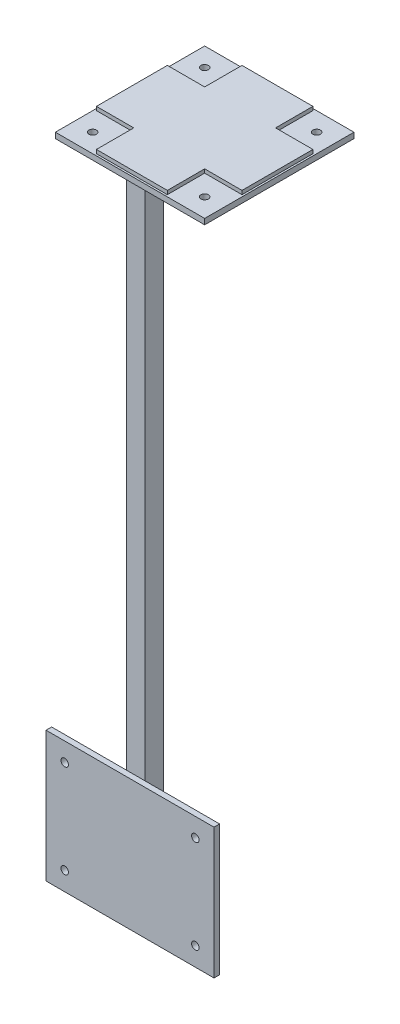
ISO-10303-21;
HEADER;
FILE_DESCRIPTION(('STEP AP214'),'2;1');
FILE_NAME('part.step','',(''),(''),'','','');
FILE_SCHEMA(('AUTOMOTIVE_DESIGN { 1 0 10303 214 1 1 1 1 }'));
ENDSEC;
DATA;
#1=APPLICATION_CONTEXT('core data for automotive mechanical design processes');
#2=APPLICATION_PROTOCOL_DEFINITION('international standard','automotive_design',2000,#1);
#3=PRODUCT_CONTEXT('',#1,'mechanical');
#4=PRODUCT('Part','Part','',(#3));
#5=PRODUCT_RELATED_PRODUCT_CATEGORY('part','',(#4));
#6=PRODUCT_DEFINITION_FORMATION('','',#4);
#7=PRODUCT_DEFINITION_CONTEXT('part definition',#1,'design');
#8=PRODUCT_DEFINITION('design','',#6,#7);
#9=PRODUCT_DEFINITION_SHAPE('','',#8);
#10=(LENGTH_UNIT() NAMED_UNIT(*) SI_UNIT(.MILLI.,.METRE.));
#11=(NAMED_UNIT(*) PLANE_ANGLE_UNIT() SI_UNIT($,.RADIAN.));
#12=(NAMED_UNIT(*) SI_UNIT($,.STERADIAN.) SOLID_ANGLE_UNIT());
#13=UNCERTAINTY_MEASURE_WITH_UNIT(LENGTH_MEASURE(1.E-05),#10,'distance_accuracy_value','');
#14=(GEOMETRIC_REPRESENTATION_CONTEXT(3) GLOBAL_UNCERTAINTY_ASSIGNED_CONTEXT((#13)) GLOBAL_UNIT_ASSIGNED_CONTEXT((#10,
#11,#12)) REPRESENTATION_CONTEXT('',''));
#15=CARTESIAN_POINT('',(0.,0.,0.));
#16=DIRECTION('',(0.,0.,1.));
#17=DIRECTION('',(1.,0.,0.));
#18=AXIS2_PLACEMENT_3D('',#15,#16,#17);
#19=CARTESIAN_POINT('',(0.,352.,-22.));
#20=DIRECTION('',(0.,1.,0.));
#21=DIRECTION('',(0.,0.,1.));
#22=AXIS2_PLACEMENT_3D('',#19,#20,#21);
#23=PLANE('',#22);
#24=DIRECTION('',(1.,0.,0.));
#25=VECTOR('',#24,1.);
#26=CARTESIAN_POINT('',(59.,352.,-101.));
#27=LINE('',#26,#25);
#28=CARTESIAN_POINT('',(59.,352.,-101.));
#29=VERTEX_POINT('',#28);
#30=CARTESIAN_POINT('',(21.,352.,-101.));
#31=VERTEX_POINT('',#30);
#32=EDGE_CURVE('P0_E244',#29,#31,#27,.F.);
#33=ORIENTED_EDGE('',*,*,#32,.T.);
#34=DIRECTION('',(0.,0.,-1.));
#35=VECTOR('',#34,1.);
#36=CARTESIAN_POINT('',(21.,352.,-101.));
#37=LINE('',#36,#35);
#38=CARTESIAN_POINT('',(21.,352.,-81.));
#39=VERTEX_POINT('',#38);
#40=EDGE_CURVE('P0_E239',#31,#39,#37,.F.);
#41=ORIENTED_EDGE('',*,*,#40,.T.);
#42=DIRECTION('',(1.,0.,0.));
#43=VECTOR('',#42,1.);
#44=CARTESIAN_POINT('',(21.,352.,-81.));
#45=LINE('',#44,#43);
#46=CARTESIAN_POINT('',(0.999999999999998,352.,-81.));
#47=VERTEX_POINT('',#46);
#48=EDGE_CURVE('P0_E133',#39,#47,#45,.F.);
#49=ORIENTED_EDGE('',*,*,#48,.T.);
#50=DIRECTION('',(0.,0.,-1.));
#51=VECTOR('',#50,1.);
#52=CARTESIAN_POINT('',(0.999999999999998,352.,-81.));
#53=LINE('',#52,#51);
#54=CARTESIAN_POINT('',(0.999999999999998,352.,-43.));
#55=VERTEX_POINT('',#54);
#56=EDGE_CURVE('P0_E131',#47,#55,#53,.F.);
#57=ORIENTED_EDGE('',*,*,#56,.T.);
#58=DIRECTION('',(-1.,0.,0.));
#59=VECTOR('',#58,1.);
#60=CARTESIAN_POINT('',(0.999999999999998,352.,-43.));
#61=LINE('',#60,#59);
#62=CARTESIAN_POINT('',(21.,352.,-43.));
#63=VERTEX_POINT('',#62);
#64=EDGE_CURVE('P0_E128',#55,#63,#61,.F.);
#65=ORIENTED_EDGE('',*,*,#64,.T.);
#66=DIRECTION('',(0.,0.,-1.));
#67=VECTOR('',#66,1.);
#68=CARTESIAN_POINT('',(21.,352.,-43.));
#69=LINE('',#68,#67);
#70=CARTESIAN_POINT('',(21.,352.,-23.));
#71=VERTEX_POINT('',#70);
#72=EDGE_CURVE('P0_E279',#63,#71,#69,.F.);
#73=ORIENTED_EDGE('',*,*,#72,.T.);
#74=DIRECTION('',(-1.,0.,0.));
#75=VECTOR('',#74,1.);
#76=CARTESIAN_POINT('',(21.,352.,-23.));
#77=LINE('',#76,#75);
#78=CARTESIAN_POINT('',(59.,352.,-23.));
#79=VERTEX_POINT('',#78);
#80=EDGE_CURVE('P0_E274',#71,#79,#77,.F.);
#81=ORIENTED_EDGE('',*,*,#80,.T.);
#82=DIRECTION('',(0.,0.,1.));
#83=VECTOR('',#82,1.);
#84=CARTESIAN_POINT('',(59.,352.,-23.));
#85=LINE('',#84,#83);
#86=CARTESIAN_POINT('',(59.,352.,-43.));
#87=VERTEX_POINT('',#86);
#88=EDGE_CURVE('P0_E269',#79,#87,#85,.F.);
#89=ORIENTED_EDGE('',*,*,#88,.T.);
#90=DIRECTION('',(-1.,0.,0.));
#91=VECTOR('',#90,1.);
#92=CARTESIAN_POINT('',(59.,352.,-43.));
#93=LINE('',#92,#91);
#94=CARTESIAN_POINT('',(79.,352.,-43.));
#95=VERTEX_POINT('',#94);
#96=EDGE_CURVE('P0_E264',#87,#95,#93,.F.);
#97=ORIENTED_EDGE('',*,*,#96,.T.);
#98=DIRECTION('',(0.,0.,1.));
#99=VECTOR('',#98,1.);
#100=CARTESIAN_POINT('',(79.,352.,-43.));
#101=LINE('',#100,#99);
#102=CARTESIAN_POINT('',(79.,352.,-81.));
#103=VERTEX_POINT('',#102);
#104=EDGE_CURVE('P0_E259',#95,#103,#101,.F.);
#105=ORIENTED_EDGE('',*,*,#104,.T.);
#106=DIRECTION('',(1.,0.,0.));
#107=VECTOR('',#106,1.);
#108=CARTESIAN_POINT('',(79.,352.,-81.));
#109=LINE('',#108,#107);
#110=CARTESIAN_POINT('',(59.,352.,-81.));
#111=VERTEX_POINT('',#110);
#112=EDGE_CURVE('P0_E254',#103,#111,#109,.F.);
#113=ORIENTED_EDGE('',*,*,#112,.T.);
#114=DIRECTION('',(0.,0.,1.));
#115=VECTOR('',#114,1.);
#116=CARTESIAN_POINT('',(59.,352.,-81.));
#117=LINE('',#116,#115);
#118=EDGE_CURVE('P0_E249',#111,#29,#117,.F.);
#119=ORIENTED_EDGE('',*,*,#118,.T.);
#120=EDGE_LOOP('',(#33,#41,#49,#57,#65,#73,#81,#89,#97,#105,#113,#119));
#121=FACE_BOUND('',#120,.T.);
#122=ADVANCED_FACE('P0_F17',(#121),#23,.T.);
#123=CARTESIAN_POINT('',(0.999999999999998,352.,-81.));
#124=DIRECTION('',(1.,0.,0.));
#125=DIRECTION('',(0.,0.,-1.));
#126=AXIS2_PLACEMENT_3D('',#123,#124,#125);
#127=PLANE('',#126);
#128=DIRECTION('',(0.,1.,0.));
#129=VECTOR('',#128,1.);
#130=CARTESIAN_POINT('',(0.999999999999998,352.,-43.));
#131=LINE('',#130,#129);
#132=CARTESIAN_POINT('',(0.999999999999998,350.,-43.));
#133=VERTEX_POINT('',#132);
#134=EDGE_CURVE('P0_E138',#133,#55,#131,.T.);
#135=ORIENTED_EDGE('',*,*,#134,.T.);
#136=ORIENTED_EDGE('',*,*,#56,.F.);
#137=DIRECTION('',(0.,1.,0.));
#138=VECTOR('',#137,1.);
#139=CARTESIAN_POINT('',(0.999999999999997,352.,-81.));
#140=LINE('',#139,#138);
#141=CARTESIAN_POINT('',(0.999999999999998,350.,-81.));
#142=VERTEX_POINT('',#141);
#143=EDGE_CURVE('P0_E233',#47,#142,#140,.F.);
#144=ORIENTED_EDGE('',*,*,#143,.T.);
#145=DIRECTION('',(0.,0.,-1.));
#146=VECTOR('',#145,1.);
#147=CARTESIAN_POINT('',(0.999999999999998,350.,-22.));
#148=LINE('',#147,#146);
#149=EDGE_CURVE('P0_E149',#142,#133,#148,.F.);
#150=ORIENTED_EDGE('',*,*,#149,.T.);
#151=EDGE_LOOP('',(#135,#136,#144,#150));
#152=FACE_BOUND('',#151,.T.);
#153=ADVANCED_FACE('P0_F148',(#152),#127,.F.);
#154=CARTESIAN_POINT('',(0.999999999999998,352.,-43.));
#155=DIRECTION('',(0.,0.,-1.));
#156=DIRECTION('',(-1.,0.,0.));
#157=AXIS2_PLACEMENT_3D('',#154,#155,#156);
#158=PLANE('',#157);
#159=DIRECTION('',(0.,1.,0.));
#160=VECTOR('',#159,1.);
#161=CARTESIAN_POINT('',(21.,352.,-43.));
#162=LINE('',#161,#160);
#163=CARTESIAN_POINT('',(21.,350.,-43.));
#164=VERTEX_POINT('',#163);
#165=EDGE_CURVE('P0_E145',#164,#63,#162,.T.);
#166=ORIENTED_EDGE('',*,*,#165,.T.);
#167=ORIENTED_EDGE('',*,*,#64,.F.);
#168=ORIENTED_EDGE('',*,*,#134,.F.);
#169=DIRECTION('',(1.,0.,0.));
#170=VECTOR('',#169,1.);
#171=CARTESIAN_POINT('',(0.,350.,-43.));
#172=LINE('',#171,#170);
#173=EDGE_CURVE('P0_E230',#133,#164,#172,.T.);
#174=ORIENTED_EDGE('',*,*,#173,.T.);
#175=EDGE_LOOP('',(#166,#167,#168,#174));
#176=FACE_BOUND('',#175,.T.);
#177=ADVANCED_FACE('P0_F142',(#176),#158,.F.);
#178=CARTESIAN_POINT('',(21.,352.,-43.));
#179=DIRECTION('',(1.,0.,0.));
#180=DIRECTION('',(0.,0.,-1.));
#181=AXIS2_PLACEMENT_3D('',#178,#179,#180);
#182=PLANE('',#181);
#183=DIRECTION('',(0.,1.,0.));
#184=VECTOR('',#183,1.);
#185=CARTESIAN_POINT('',(21.,352.,-23.));
#186=LINE('',#185,#184);
#187=CARTESIAN_POINT('',(21.,350.,-23.));
#188=VERTEX_POINT('',#187);
#189=EDGE_CURVE('P0_E276',#188,#71,#186,.T.);
#190=ORIENTED_EDGE('',*,*,#189,.T.);
#191=ORIENTED_EDGE('',*,*,#72,.F.);
#192=ORIENTED_EDGE('',*,*,#165,.F.);
#193=DIRECTION('',(0.,0.,-1.));
#194=VECTOR('',#193,1.);
#195=CARTESIAN_POINT('',(21.,350.,-22.));
#196=LINE('',#195,#194);
#197=EDGE_CURVE('P0_E227',#164,#188,#196,.F.);
#198=ORIENTED_EDGE('',*,*,#197,.T.);
#199=EDGE_LOOP('',(#190,#191,#192,#198));
#200=FACE_BOUND('',#199,.T.);
#201=ADVANCED_FACE('P0_F286',(#200),#182,.F.);
#202=CARTESIAN_POINT('',(21.,352.,-23.));
#203=DIRECTION('',(0.,0.,-1.));
#204=DIRECTION('',(-1.,0.,0.));
#205=AXIS2_PLACEMENT_3D('',#202,#203,#204);
#206=PLANE('',#205);
#207=DIRECTION('',(0.,1.,0.));
#208=VECTOR('',#207,1.);
#209=CARTESIAN_POINT('',(59.,352.,-23.));
#210=LINE('',#209,#208);
#211=CARTESIAN_POINT('',(59.,350.,-23.));
#212=VERTEX_POINT('',#211);
#213=EDGE_CURVE('P0_E271',#212,#79,#210,.T.);
#214=ORIENTED_EDGE('',*,*,#213,.T.);
#215=ORIENTED_EDGE('',*,*,#80,.F.);
#216=ORIENTED_EDGE('',*,*,#189,.F.);
#217=DIRECTION('',(1.,0.,0.));
#218=VECTOR('',#217,1.);
#219=CARTESIAN_POINT('',(0.,350.,-23.));
#220=LINE('',#219,#218);
#221=EDGE_CURVE('P0_E224',#188,#212,#220,.T.);
#222=ORIENTED_EDGE('',*,*,#221,.T.);
#223=EDGE_LOOP('',(#214,#215,#216,#222));
#224=FACE_BOUND('',#223,.T.);
#225=ADVANCED_FACE('P0_F284',(#224),#206,.F.);
#226=CARTESIAN_POINT('',(59.,352.,-23.));
#227=DIRECTION('',(-1.,0.,0.));
#228=DIRECTION('',(0.,0.,1.));
#229=AXIS2_PLACEMENT_3D('',#226,#227,#228);
#230=PLANE('',#229);
#231=DIRECTION('',(0.,1.,0.));
#232=VECTOR('',#231,1.);
#233=CARTESIAN_POINT('',(59.,352.,-43.));
#234=LINE('',#233,#232);
#235=CARTESIAN_POINT('',(59.,350.,-43.));
#236=VERTEX_POINT('',#235);
#237=EDGE_CURVE('P0_E266',#236,#87,#234,.T.);
#238=ORIENTED_EDGE('',*,*,#237,.T.);
#239=ORIENTED_EDGE('',*,*,#88,.F.);
#240=ORIENTED_EDGE('',*,*,#213,.F.);
#241=DIRECTION('',(0.,0.,-1.));
#242=VECTOR('',#241,1.);
#243=CARTESIAN_POINT('',(59.,350.,-22.));
#244=LINE('',#243,#242);
#245=EDGE_CURVE('P0_E221',#212,#236,#244,.T.);
#246=ORIENTED_EDGE('',*,*,#245,.T.);
#247=EDGE_LOOP('',(#238,#239,#240,#246));
#248=FACE_BOUND('',#247,.T.);
#249=ADVANCED_FACE('P0_F295',(#248),#230,.F.);
#250=CARTESIAN_POINT('',(59.,352.,-43.));
#251=DIRECTION('',(0.,0.,-1.));
#252=DIRECTION('',(-1.,0.,0.));
#253=AXIS2_PLACEMENT_3D('',#250,#251,#252);
#254=PLANE('',#253);
#255=DIRECTION('',(0.,1.,0.));
#256=VECTOR('',#255,1.);
#257=CARTESIAN_POINT('',(79.,352.,-43.));
#258=LINE('',#257,#256);
#259=CARTESIAN_POINT('',(79.,350.,-43.));
#260=VERTEX_POINT('',#259);
#261=EDGE_CURVE('P0_E261',#260,#95,#258,.T.);
#262=ORIENTED_EDGE('',*,*,#261,.T.);
#263=ORIENTED_EDGE('',*,*,#96,.F.);
#264=ORIENTED_EDGE('',*,*,#237,.F.);
#265=DIRECTION('',(1.,0.,0.));
#266=VECTOR('',#265,1.);
#267=CARTESIAN_POINT('',(0.,350.,-43.));
#268=LINE('',#267,#266);
#269=EDGE_CURVE('P0_E218',#236,#260,#268,.T.);
#270=ORIENTED_EDGE('',*,*,#269,.T.);
#271=EDGE_LOOP('',(#262,#263,#264,#270));
#272=FACE_BOUND('',#271,.T.);
#273=ADVANCED_FACE('P0_F299',(#272),#254,.F.);
#274=CARTESIAN_POINT('',(79.,352.,-43.));
#275=DIRECTION('',(-1.,0.,0.));
#276=DIRECTION('',(0.,0.,1.));
#277=AXIS2_PLACEMENT_3D('',#274,#275,#276);
#278=PLANE('',#277);
#279=DIRECTION('',(0.,1.,0.));
#280=VECTOR('',#279,1.);
#281=CARTESIAN_POINT('',(79.,352.,-81.));
#282=LINE('',#281,#280);
#283=CARTESIAN_POINT('',(79.,350.,-81.));
#284=VERTEX_POINT('',#283);
#285=EDGE_CURVE('P0_E256',#284,#103,#282,.T.);
#286=ORIENTED_EDGE('',*,*,#285,.T.);
#287=ORIENTED_EDGE('',*,*,#104,.F.);
#288=ORIENTED_EDGE('',*,*,#261,.F.);
#289=DIRECTION('',(0.,0.,-1.));
#290=VECTOR('',#289,1.);
#291=CARTESIAN_POINT('',(79.,350.,-22.));
#292=LINE('',#291,#290);
#293=EDGE_CURVE('P0_E215',#260,#284,#292,.T.);
#294=ORIENTED_EDGE('',*,*,#293,.T.);
#295=EDGE_LOOP('',(#286,#287,#288,#294));
#296=FACE_BOUND('',#295,.T.);
#297=ADVANCED_FACE('P0_F301',(#296),#278,.F.);
#298=CARTESIAN_POINT('',(79.,352.,-81.));
#299=DIRECTION('',(0.,0.,1.));
#300=DIRECTION('',(1.,0.,0.));
#301=AXIS2_PLACEMENT_3D('',#298,#299,#300);
#302=PLANE('',#301);
#303=DIRECTION('',(0.,1.,0.));
#304=VECTOR('',#303,1.);
#305=CARTESIAN_POINT('',(59.,352.,-81.));
#306=LINE('',#305,#304);
#307=CARTESIAN_POINT('',(59.,350.,-81.));
#308=VERTEX_POINT('',#307);
#309=EDGE_CURVE('P0_E251',#308,#111,#306,.T.);
#310=ORIENTED_EDGE('',*,*,#309,.T.);
#311=ORIENTED_EDGE('',*,*,#112,.F.);
#312=ORIENTED_EDGE('',*,*,#285,.F.);
#313=DIRECTION('',(1.,0.,0.));
#314=VECTOR('',#313,1.);
#315=CARTESIAN_POINT('',(0.,350.,-81.));
#316=LINE('',#315,#314);
#317=EDGE_CURVE('P0_E212',#284,#308,#316,.F.);
#318=ORIENTED_EDGE('',*,*,#317,.T.);
#319=EDGE_LOOP('',(#310,#311,#312,#318));
#320=FACE_BOUND('',#319,.T.);
#321=ADVANCED_FACE('P0_F306',(#320),#302,.F.);
#322=CARTESIAN_POINT('',(59.,352.,-81.));
#323=DIRECTION('',(-1.,0.,0.));
#324=DIRECTION('',(0.,0.,1.));
#325=AXIS2_PLACEMENT_3D('',#322,#323,#324);
#326=PLANE('',#325);
#327=DIRECTION('',(0.,1.,0.));
#328=VECTOR('',#327,1.);
#329=CARTESIAN_POINT('',(59.,352.,-101.));
#330=LINE('',#329,#328);
#331=CARTESIAN_POINT('',(59.,350.,-101.));
#332=VERTEX_POINT('',#331);
#333=EDGE_CURVE('P0_E246',#332,#29,#330,.T.);
#334=ORIENTED_EDGE('',*,*,#333,.T.);
#335=ORIENTED_EDGE('',*,*,#118,.F.);
#336=ORIENTED_EDGE('',*,*,#309,.F.);
#337=DIRECTION('',(0.,0.,-1.));
#338=VECTOR('',#337,1.);
#339=CARTESIAN_POINT('',(59.,350.,-22.));
#340=LINE('',#339,#338);
#341=EDGE_CURVE('P0_E209',#308,#332,#340,.T.);
#342=ORIENTED_EDGE('',*,*,#341,.T.);
#343=EDGE_LOOP('',(#334,#335,#336,#342));
#344=FACE_BOUND('',#343,.T.);
#345=ADVANCED_FACE('P0_F311',(#344),#326,.F.);
#346=CARTESIAN_POINT('',(59.,352.,-101.));
#347=DIRECTION('',(0.,0.,1.));
#348=DIRECTION('',(1.,0.,0.));
#349=AXIS2_PLACEMENT_3D('',#346,#347,#348);
#350=PLANE('',#349);
#351=DIRECTION('',(0.,1.,0.));
#352=VECTOR('',#351,1.);
#353=CARTESIAN_POINT('',(21.,352.,-101.));
#354=LINE('',#353,#352);
#355=CARTESIAN_POINT('',(21.,350.,-101.));
#356=VERTEX_POINT('',#355);
#357=EDGE_CURVE('P0_E241',#356,#31,#354,.T.);
#358=ORIENTED_EDGE('',*,*,#357,.T.);
#359=ORIENTED_EDGE('',*,*,#32,.F.);
#360=ORIENTED_EDGE('',*,*,#333,.F.);
#361=DIRECTION('',(1.,0.,0.));
#362=VECTOR('',#361,1.);
#363=CARTESIAN_POINT('',(0.,350.,-101.));
#364=LINE('',#363,#362);
#365=EDGE_CURVE('P0_E206',#332,#356,#364,.F.);
#366=ORIENTED_EDGE('',*,*,#365,.T.);
#367=EDGE_LOOP('',(#358,#359,#360,#366));
#368=FACE_BOUND('',#367,.T.);
#369=ADVANCED_FACE('P0_F313',(#368),#350,.F.);
#370=CARTESIAN_POINT('',(21.,352.,-101.));
#371=DIRECTION('',(1.,0.,0.));
#372=DIRECTION('',(0.,0.,-1.));
#373=AXIS2_PLACEMENT_3D('',#370,#371,#372);
#374=PLANE('',#373);
#375=DIRECTION('',(0.,1.,0.));
#376=VECTOR('',#375,1.);
#377=CARTESIAN_POINT('',(21.,352.,-81.));
#378=LINE('',#377,#376);
#379=CARTESIAN_POINT('',(21.,350.,-81.));
#380=VERTEX_POINT('',#379);
#381=EDGE_CURVE('P0_E236',#380,#39,#378,.T.);
#382=ORIENTED_EDGE('',*,*,#381,.T.);
#383=ORIENTED_EDGE('',*,*,#40,.F.);
#384=ORIENTED_EDGE('',*,*,#357,.F.);
#385=DIRECTION('',(0.,0.,-1.));
#386=VECTOR('',#385,1.);
#387=CARTESIAN_POINT('',(21.,350.,-22.));
#388=LINE('',#387,#386);
#389=EDGE_CURVE('P0_E203',#356,#380,#388,.F.);
#390=ORIENTED_EDGE('',*,*,#389,.T.);
#391=EDGE_LOOP('',(#382,#383,#384,#390));
#392=FACE_BOUND('',#391,.T.);
#393=ADVANCED_FACE('P0_F316',(#392),#374,.F.);
#394=CARTESIAN_POINT('',(21.,352.,-81.));
#395=DIRECTION('',(0.,0.,1.));
#396=DIRECTION('',(1.,0.,0.));
#397=AXIS2_PLACEMENT_3D('',#394,#395,#396);
#398=PLANE('',#397);
#399=ORIENTED_EDGE('',*,*,#143,.F.);
#400=ORIENTED_EDGE('',*,*,#48,.F.);
#401=ORIENTED_EDGE('',*,*,#381,.F.);
#402=DIRECTION('',(1.,0.,0.));
#403=VECTOR('',#402,1.);
#404=CARTESIAN_POINT('',(0.,350.,-81.));
#405=LINE('',#404,#403);
#406=EDGE_CURVE('P0_E200',#380,#142,#405,.F.);
#407=ORIENTED_EDGE('',*,*,#406,.T.);
#408=EDGE_LOOP('',(#399,#400,#401,#407));
#409=FACE_BOUND('',#408,.T.);
#410=ADVANCED_FACE('P0_F319',(#409),#398,.F.);
#411=CARTESIAN_POINT('',(0.,350.,-22.));
#412=DIRECTION('',(0.,-1.,0.));
#413=DIRECTION('',(0.,0.,-1.));
#414=AXIS2_PLACEMENT_3D('',#411,#412,#413);
#415=PLANE('',#414);
#416=ORIENTED_EDGE('',*,*,#389,.F.);
#417=ORIENTED_EDGE('',*,*,#365,.F.);
#418=ORIENTED_EDGE('',*,*,#341,.F.);
#419=ORIENTED_EDGE('',*,*,#317,.F.);
#420=ORIENTED_EDGE('',*,*,#293,.F.);
#421=ORIENTED_EDGE('',*,*,#269,.F.);
#422=ORIENTED_EDGE('',*,*,#245,.F.);
#423=ORIENTED_EDGE('',*,*,#221,.F.);
#424=ORIENTED_EDGE('',*,*,#197,.F.);
#425=ORIENTED_EDGE('',*,*,#173,.F.);
#426=ORIENTED_EDGE('',*,*,#149,.F.);
#427=ORIENTED_EDGE('',*,*,#406,.F.);
#428=EDGE_LOOP('',(#416,#417,#418,#419,#420,#421,#422,#423,#424,#425,#426,#427));
#429=FACE_BOUND('',#428,.T.);
#430=CARTESIAN_POINT('',(10.,350.,-32.));
#431=DIRECTION('',(0.,1.,0.));
#432=DIRECTION('',(0.,0.,1.));
#433=AXIS2_PLACEMENT_3D('',#430,#431,#432);
#434=CIRCLE('',#433,2.);
#435=CARTESIAN_POINT('',(10.,350.,-30.));
#436=VERTEX_POINT('',#435);
#437=EDGE_CURVE('P0_E20',#436,#436,#434,.F.);
#438=ORIENTED_EDGE('',*,*,#437,.T.);
#439=EDGE_LOOP('',(#438));
#440=FACE_BOUND('',#439,.T.);
#441=CARTESIAN_POINT('',(70.,350.,-32.));
#442=DIRECTION('',(0.,1.,0.));
#443=DIRECTION('',(0.,0.,1.));
#444=AXIS2_PLACEMENT_3D('',#441,#442,#443);
#445=CIRCLE('',#444,2.);
#446=CARTESIAN_POINT('',(70.,350.,-30.));
#447=VERTEX_POINT('',#446);
#448=EDGE_CURVE('P0_E162',#447,#447,#445,.F.);
#449=ORIENTED_EDGE('',*,*,#448,.T.);
#450=EDGE_LOOP('',(#449));
#451=FACE_BOUND('',#450,.T.);
#452=CARTESIAN_POINT('',(70.,350.,-92.));
#453=DIRECTION('',(0.,1.,0.));
#454=DIRECTION('',(0.,0.,1.));
#455=AXIS2_PLACEMENT_3D('',#452,#453,#454);
#456=CIRCLE('',#455,2.);
#457=CARTESIAN_POINT('',(70.,350.,-90.));
#458=VERTEX_POINT('',#457);
#459=EDGE_CURVE('P0_E166',#458,#458,#456,.F.);
#460=ORIENTED_EDGE('',*,*,#459,.T.);
#461=EDGE_LOOP('',(#460));
#462=FACE_BOUND('',#461,.T.);
#463=CARTESIAN_POINT('',(10.,350.,-92.));
#464=DIRECTION('',(0.,1.,0.));
#465=DIRECTION('',(0.,0.,1.));
#466=AXIS2_PLACEMENT_3D('',#463,#464,#465);
#467=CIRCLE('',#466,2.);
#468=CARTESIAN_POINT('',(10.,350.,-90.));
#469=VERTEX_POINT('',#468);
#470=EDGE_CURVE('P0_E168',#469,#469,#467,.F.);
#471=ORIENTED_EDGE('',*,*,#470,.T.);
#472=EDGE_LOOP('',(#471));
#473=FACE_BOUND('',#472,.T.);
#474=DIRECTION('',(-1.,0.,0.));
#475=VECTOR('',#474,1.);
#476=CARTESIAN_POINT('',(0.,350.,-22.));
#477=LINE('',#476,#475);
#478=CARTESIAN_POINT('',(0.,350.,-22.));
#479=VERTEX_POINT('',#478);
#480=CARTESIAN_POINT('',(80.,350.,-22.));
#481=VERTEX_POINT('',#480);
#482=EDGE_CURVE('P0_E198',#479,#481,#477,.F.);
#483=ORIENTED_EDGE('',*,*,#482,.T.);
#484=DIRECTION('',(0.,0.,1.));
#485=VECTOR('',#484,1.);
#486=CARTESIAN_POINT('',(80.,350.,-22.));
#487=LINE('',#486,#485);
#488=CARTESIAN_POINT('',(80.,350.,-102.));
#489=VERTEX_POINT('',#488);
#490=EDGE_CURVE('P0_E193',#481,#489,#487,.F.);
#491=ORIENTED_EDGE('',*,*,#490,.T.);
#492=DIRECTION('',(1.,0.,0.));
#493=VECTOR('',#492,1.);
#494=CARTESIAN_POINT('',(0.,350.,-102.));
#495=LINE('',#494,#493);
#496=CARTESIAN_POINT('',(0.,350.,-102.));
#497=VERTEX_POINT('',#496);
#498=EDGE_CURVE('P0_E188',#489,#497,#495,.F.);
#499=ORIENTED_EDGE('',*,*,#498,.T.);
#500=DIRECTION('',(0.,0.,-1.));
#501=VECTOR('',#500,1.);
#502=CARTESIAN_POINT('',(0.,350.,-22.));
#503=LINE('',#502,#501);
#504=EDGE_CURVE('P0_E177',#497,#479,#503,.F.);
#505=ORIENTED_EDGE('',*,*,#504,.T.);
#506=EDGE_LOOP('',(#483,#491,#499,#505));
#507=FACE_BOUND('',#506,.T.);
#508=ADVANCED_FACE('P0_F290',(#429,#440,#451,#462,#473,#507),#415,.F.);
#509=CARTESIAN_POINT('',(0.,350.,-22.));
#510=DIRECTION('',(0.,0.,-1.));
#511=DIRECTION('',(-1.,0.,0.));
#512=AXIS2_PLACEMENT_3D('',#509,#510,#511);
#513=PLANE('',#512);
#514=DIRECTION('',(0.,1.,0.));
#515=VECTOR('',#514,1.);
#516=CARTESIAN_POINT('',(80.,350.,-22.));
#517=LINE('',#516,#515);
#518=CARTESIAN_POINT('',(80.,347.,-22.));
#519=VERTEX_POINT('',#518);
#520=EDGE_CURVE('P0_E195',#519,#481,#517,.T.);
#521=ORIENTED_EDGE('',*,*,#520,.T.);
#522=ORIENTED_EDGE('',*,*,#482,.F.);
#523=DIRECTION('',(0.,1.,0.));
#524=VECTOR('',#523,1.);
#525=CARTESIAN_POINT('',(0.,350.,-22.));
#526=LINE('',#525,#524);
#527=CARTESIAN_POINT('',(0.,347.,-22.));
#528=VERTEX_POINT('',#527);
#529=EDGE_CURVE('P0_E173',#479,#528,#526,.F.);
#530=ORIENTED_EDGE('',*,*,#529,.T.);
#531=DIRECTION('',(1.,0.,0.));
#532=VECTOR('',#531,1.);
#533=CARTESIAN_POINT('',(0.,347.,-22.));
#534=LINE('',#533,#532);
#535=EDGE_CURVE('P0_E165',#528,#519,#534,.T.);
#536=ORIENTED_EDGE('',*,*,#535,.T.);
#537=EDGE_LOOP('',(#521,#522,#530,#536));
#538=FACE_BOUND('',#537,.T.);
#539=ADVANCED_FACE('P0_F327',(#538),#513,.F.);
#540=CARTESIAN_POINT('',(80.,350.,-22.));
#541=DIRECTION('',(-1.,0.,0.));
#542=DIRECTION('',(0.,0.,1.));
#543=AXIS2_PLACEMENT_3D('',#540,#541,#542);
#544=PLANE('',#543);
#545=DIRECTION('',(0.,1.,0.));
#546=VECTOR('',#545,1.);
#547=CARTESIAN_POINT('',(80.,350.,-102.));
#548=LINE('',#547,#546);
#549=CARTESIAN_POINT('',(80.,347.,-102.));
#550=VERTEX_POINT('',#549);
#551=EDGE_CURVE('P0_E190',#550,#489,#548,.T.);
#552=ORIENTED_EDGE('',*,*,#551,.T.);
#553=ORIENTED_EDGE('',*,*,#490,.F.);
#554=ORIENTED_EDGE('',*,*,#520,.F.);
#555=DIRECTION('',(0.,0.,1.));
#556=VECTOR('',#555,1.);
#557=CARTESIAN_POINT('',(80.,347.,-22.));
#558=LINE('',#557,#556);
#559=EDGE_CURVE('P0_E372',#519,#550,#558,.F.);
#560=ORIENTED_EDGE('',*,*,#559,.T.);
#561=EDGE_LOOP('',(#552,#553,#554,#560));
#562=FACE_BOUND('',#561,.T.);
#563=ADVANCED_FACE('P0_F361',(#562),#544,.F.);
#564=CARTESIAN_POINT('',(0.,350.,-102.));
#565=DIRECTION('',(0.,0.,1.));
#566=DIRECTION('',(1.,0.,0.));
#567=AXIS2_PLACEMENT_3D('',#564,#565,#566);
#568=PLANE('',#567);
#569=DIRECTION('',(0.,1.,0.));
#570=VECTOR('',#569,1.);
#571=CARTESIAN_POINT('',(0.,350.,-102.));
#572=LINE('',#571,#570);
#573=CARTESIAN_POINT('',(0.,347.,-102.));
#574=VERTEX_POINT('',#573);
#575=EDGE_CURVE('P0_E35',#574,#497,#572,.T.);
#576=ORIENTED_EDGE('',*,*,#575,.T.);
#577=ORIENTED_EDGE('',*,*,#498,.F.);
#578=ORIENTED_EDGE('',*,*,#551,.F.);
#579=DIRECTION('',(1.,0.,0.));
#580=VECTOR('',#579,1.);
#581=CARTESIAN_POINT('',(0.,347.,-102.));
#582=LINE('',#581,#580);
#583=EDGE_CURVE('P0_E376',#550,#574,#582,.F.);
#584=ORIENTED_EDGE('',*,*,#583,.T.);
#585=EDGE_LOOP('',(#576,#577,#578,#584));
#586=FACE_BOUND('',#585,.T.);
#587=ADVANCED_FACE('P0_F358',(#586),#568,.F.);
#588=CARTESIAN_POINT('',(0.,350.,-22.));
#589=DIRECTION('',(1.,0.,0.));
#590=DIRECTION('',(0.,0.,-1.));
#591=AXIS2_PLACEMENT_3D('',#588,#589,#590);
#592=PLANE('',#591);
#593=ORIENTED_EDGE('',*,*,#529,.F.);
#594=ORIENTED_EDGE('',*,*,#504,.F.);
#595=ORIENTED_EDGE('',*,*,#575,.F.);
#596=DIRECTION('',(0.,0.,1.));
#597=VECTOR('',#596,1.);
#598=CARTESIAN_POINT('',(0.,347.,-22.));
#599=LINE('',#598,#597);
#600=EDGE_CURVE('P0_E161',#574,#528,#599,.T.);
#601=ORIENTED_EDGE('',*,*,#600,.T.);
#602=EDGE_LOOP('',(#593,#594,#595,#601));
#603=FACE_BOUND('',#602,.T.);
#604=ADVANCED_FACE('P0_F354',(#603),#592,.F.);
#605=CARTESIAN_POINT('',(10.,-0.00100000000002876,-32.));
#606=DIRECTION('',(0.,1.,0.));
#607=DIRECTION('',(0.,0.,1.));
#608=AXIS2_PLACEMENT_3D('',#605,#606,#607);
#609=CYLINDRICAL_SURFACE('',#608,2.);
#610=ORIENTED_EDGE('',*,*,#437,.F.);
#611=EDGE_LOOP('',(#610));
#612=FACE_BOUND('',#611,.T.);
#613=CARTESIAN_POINT('',(10.,347.,-32.));
#614=DIRECTION('',(0.,1.,0.));
#615=DIRECTION('',(0.,0.,1.));
#616=AXIS2_PLACEMENT_3D('',#613,#614,#615);
#617=CIRCLE('',#616,2.);
#618=CARTESIAN_POINT('',(10.,347.,-30.));
#619=VERTEX_POINT('',#618);
#620=EDGE_CURVE('P0_E158',#619,#619,#617,.F.);
#621=ORIENTED_EDGE('',*,*,#620,.T.);
#622=EDGE_LOOP('',(#621));
#623=FACE_BOUND('',#622,.T.);
#624=ADVANCED_FACE('P0_F350',(#612,#623),#609,.F.);
#625=CARTESIAN_POINT('',(10.,-0.00100000000002876,-92.));
#626=DIRECTION('',(0.,1.,0.));
#627=DIRECTION('',(0.,0.,1.));
#628=AXIS2_PLACEMENT_3D('',#625,#626,#627);
#629=CYLINDRICAL_SURFACE('',#628,2.);
#630=ORIENTED_EDGE('',*,*,#470,.F.);
#631=EDGE_LOOP('',(#630));
#632=FACE_BOUND('',#631,.T.);
#633=CARTESIAN_POINT('',(10.,347.,-92.));
#634=DIRECTION('',(0.,1.,0.));
#635=DIRECTION('',(0.,0.,1.));
#636=AXIS2_PLACEMENT_3D('',#633,#634,#635);
#637=CIRCLE('',#636,2.);
#638=CARTESIAN_POINT('',(10.,347.,-90.));
#639=VERTEX_POINT('',#638);
#640=EDGE_CURVE('P0_E155',#639,#639,#637,.F.);
#641=ORIENTED_EDGE('',*,*,#640,.T.);
#642=EDGE_LOOP('',(#641));
#643=FACE_BOUND('',#642,.T.);
#644=ADVANCED_FACE('P0_F346',(#632,#643),#629,.F.);
#645=CARTESIAN_POINT('',(70.,-0.00100000000002876,-92.));
#646=DIRECTION('',(0.,1.,0.));
#647=DIRECTION('',(0.,0.,1.));
#648=AXIS2_PLACEMENT_3D('',#645,#646,#647);
#649=CYLINDRICAL_SURFACE('',#648,2.);
#650=ORIENTED_EDGE('',*,*,#459,.F.);
#651=EDGE_LOOP('',(#650));
#652=FACE_BOUND('',#651,.T.);
#653=CARTESIAN_POINT('',(70.,347.,-92.));
#654=DIRECTION('',(0.,1.,0.));
#655=DIRECTION('',(0.,0.,1.));
#656=AXIS2_PLACEMENT_3D('',#653,#654,#655);
#657=CIRCLE('',#656,2.);
#658=CARTESIAN_POINT('',(70.,347.,-90.));
#659=VERTEX_POINT('',#658);
#660=EDGE_CURVE('P0_E26',#659,#659,#657,.F.);
#661=ORIENTED_EDGE('',*,*,#660,.T.);
#662=EDGE_LOOP('',(#661));
#663=FACE_BOUND('',#662,.T.);
#664=ADVANCED_FACE('P0_F338',(#652,#663),#649,.F.);
#665=CARTESIAN_POINT('',(70.,-0.00100000000002876,-32.));
#666=DIRECTION('',(0.,1.,0.));
#667=DIRECTION('',(0.,0.,1.));
#668=AXIS2_PLACEMENT_3D('',#665,#666,#667);
#669=CYLINDRICAL_SURFACE('',#668,2.);
#670=ORIENTED_EDGE('',*,*,#448,.F.);
#671=EDGE_LOOP('',(#670));
#672=FACE_BOUND('',#671,.T.);
#673=CARTESIAN_POINT('',(70.,347.,-32.));
#674=DIRECTION('',(0.,1.,0.));
#675=DIRECTION('',(0.,0.,1.));
#676=AXIS2_PLACEMENT_3D('',#673,#674,#675);
#677=CIRCLE('',#676,2.);
#678=CARTESIAN_POINT('',(70.,347.,-30.));
#679=VERTEX_POINT('',#678);
#680=EDGE_CURVE('P0_E11',#679,#679,#677,.F.);
#681=ORIENTED_EDGE('',*,*,#680,.T.);
#682=EDGE_LOOP('',(#681));
#683=FACE_BOUND('',#682,.T.);
#684=ADVANCED_FACE('P0_F332',(#672,#683),#669,.F.);
#685=CARTESIAN_POINT('',(0.,347.,-22.));
#686=DIRECTION('',(0.,1.,0.));
#687=DIRECTION('',(0.,0.,1.));
#688=AXIS2_PLACEMENT_3D('',#685,#686,#687);
#689=PLANE('',#688);
#690=ORIENTED_EDGE('',*,*,#680,.F.);
#691=EDGE_LOOP('',(#690));
#692=FACE_BOUND('',#691,.T.);
#693=ORIENTED_EDGE('',*,*,#660,.F.);
#694=EDGE_LOOP('',(#693));
#695=FACE_BOUND('',#694,.T.);
#696=ORIENTED_EDGE('',*,*,#640,.F.);
#697=EDGE_LOOP('',(#696));
#698=FACE_BOUND('',#697,.T.);
#699=ORIENTED_EDGE('',*,*,#620,.F.);
#700=EDGE_LOOP('',(#699));
#701=FACE_BOUND('',#700,.T.);
#702=ORIENTED_EDGE('',*,*,#583,.F.);
#703=ORIENTED_EDGE('',*,*,#559,.F.);
#704=ORIENTED_EDGE('',*,*,#535,.F.);
#705=ORIENTED_EDGE('',*,*,#600,.F.);
#706=EDGE_LOOP('',(#702,#703,#704,#705));
#707=FACE_BOUND('',#706,.T.);
#708=ADVANCED_FACE('P0_F330',(#692,#695,#698,#701,#707),#689,.F.);
#709=CLOSED_SHELL('',(#122,#153,#177,#201,#225,#249,#273,#297,#321,#345,#369,#393,#410,#508,
#539,#563,#587,#604,#624,#644,#664,#684,#708));
#710=MANIFOLD_SOLID_BREP('P0_B1',#709);
#711=CARTESIAN_POINT('',(0.,347.,0.));
#712=DIRECTION('',(0.,1.,0.));
#713=DIRECTION('',(0.,0.,1.));
#714=AXIS2_PLACEMENT_3D('',#711,#712,#713);
#715=PLANE('',#714);
#716=DIRECTION('',(0.,0.,-1.));
#717=VECTOR('',#716,1.);
#718=CARTESIAN_POINT('',(35.,347.,-25.));
#719=LINE('',#718,#717);
#720=CARTESIAN_POINT('',(35.,347.,-35.));
#721=VERTEX_POINT('',#720);
#722=CARTESIAN_POINT('',(35.,347.,-25.));
#723=VERTEX_POINT('',#722);
#724=EDGE_CURVE('P1_E88',#721,#723,#719,.F.);
#725=ORIENTED_EDGE('',*,*,#724,.T.);
#726=DIRECTION('',(-1.,0.,0.));
#727=VECTOR('',#726,1.);
#728=CARTESIAN_POINT('',(35.,347.,-25.));
#729=LINE('',#728,#727);
#730=CARTESIAN_POINT('',(45.,347.,-25.));
#731=VERTEX_POINT('',#730);
#732=EDGE_CURVE('P1_E90',#723,#731,#729,.F.);
#733=ORIENTED_EDGE('',*,*,#732,.T.);
#734=DIRECTION('',(0.,0.,1.));
#735=VECTOR('',#734,1.);
#736=CARTESIAN_POINT('',(45.,347.,-25.));
#737=LINE('',#736,#735);
#738=CARTESIAN_POINT('',(45.,347.,-35.));
#739=VERTEX_POINT('',#738);
#740=EDGE_CURVE('P1_E177',#731,#739,#737,.F.);
#741=ORIENTED_EDGE('',*,*,#740,.T.);
#742=DIRECTION('',(1.,0.,0.));
#743=VECTOR('',#742,1.);
#744=CARTESIAN_POINT('',(35.,347.,-35.));
#745=LINE('',#744,#743);
#746=EDGE_CURVE('P1_E86',#739,#721,#745,.F.);
#747=ORIENTED_EDGE('',*,*,#746,.T.);
#748=EDGE_LOOP('',(#725,#733,#741,#747));
#749=FACE_BOUND('',#748,.T.);
#750=ADVANCED_FACE('P1_F17',(#749),#715,.T.);
#751=CARTESIAN_POINT('',(35.,347.,-25.));
#752=DIRECTION('',(0.,0.,-1.));
#753=DIRECTION('',(-1.,0.,0.));
#754=AXIS2_PLACEMENT_3D('',#751,#752,#753);
#755=PLANE('',#754);
#756=DIRECTION('',(0.,1.,0.));
#757=VECTOR('',#756,1.);
#758=CARTESIAN_POINT('',(45.,347.,-25.));
#759=LINE('',#758,#757);
#760=CARTESIAN_POINT('',(45.,70.,-25.));
#761=VERTEX_POINT('',#760);
#762=EDGE_CURVE('P1_E101',#761,#731,#759,.T.);
#763=ORIENTED_EDGE('',*,*,#762,.T.);
#764=ORIENTED_EDGE('',*,*,#732,.F.);
#765=DIRECTION('',(0.,1.,0.));
#766=VECTOR('',#765,1.);
#767=CARTESIAN_POINT('',(35.,347.,-25.));
#768=LINE('',#767,#766);
#769=CARTESIAN_POINT('',(35.,70.,-25.));
#770=VERTEX_POINT('',#769);
#771=EDGE_CURVE('P1_E95',#723,#770,#768,.F.);
#772=ORIENTED_EDGE('',*,*,#771,.T.);
#773=DIRECTION('',(1.,0.,0.));
#774=VECTOR('',#773,1.);
#775=CARTESIAN_POINT('',(45.,70.,-25.));
#776=LINE('',#775,#774);
#777=EDGE_CURVE('P1_E166',#770,#761,#776,.T.);
#778=ORIENTED_EDGE('',*,*,#777,.T.);
#779=EDGE_LOOP('',(#763,#764,#772,#778));
#780=FACE_BOUND('',#779,.T.);
#781=ADVANCED_FACE('P1_F98',(#780),#755,.F.);
#782=CARTESIAN_POINT('',(35.,347.,-25.));
#783=DIRECTION('',(1.,0.,0.));
#784=DIRECTION('',(0.,0.,-1.));
#785=AXIS2_PLACEMENT_3D('',#782,#783,#784);
#786=PLANE('',#785);
#787=DIRECTION('',(0.,1.,0.));
#788=VECTOR('',#787,1.);
#789=CARTESIAN_POINT('',(35.,0.,-25.));
#790=LINE('',#789,#788);
#791=CARTESIAN_POINT('',(35.,0.,-25.));
#792=VERTEX_POINT('',#791);
#793=EDGE_CURVE('P1_E106',#792,#770,#790,.T.);
#794=ORIENTED_EDGE('',*,*,#793,.T.);
#795=ORIENTED_EDGE('',*,*,#771,.F.);
#796=ORIENTED_EDGE('',*,*,#724,.F.);
#797=DIRECTION('',(0.,1.,0.));
#798=VECTOR('',#797,1.);
#799=CARTESIAN_POINT('',(35.,347.,-35.));
#800=LINE('',#799,#798);
#801=CARTESIAN_POINT('',(35.,0.,-35.));
#802=VERTEX_POINT('',#801);
#803=EDGE_CURVE('P1_E109',#721,#802,#800,.F.);
#804=ORIENTED_EDGE('',*,*,#803,.T.);
#805=DIRECTION('',(0.,0.,-1.));
#806=VECTOR('',#805,1.);
#807=CARTESIAN_POINT('',(35.,0.,0.));
#808=LINE('',#807,#806);
#809=EDGE_CURVE('P1_E152',#792,#802,#808,.T.);
#810=ORIENTED_EDGE('',*,*,#809,.F.);
#811=EDGE_LOOP('',(#794,#795,#796,#804,#810));
#812=FACE_BOUND('',#811,.T.);
#813=ADVANCED_FACE('P1_F104',(#812),#786,.F.);
#814=CARTESIAN_POINT('',(35.,347.,-35.));
#815=DIRECTION('',(0.,0.,1.));
#816=DIRECTION('',(1.,0.,0.));
#817=AXIS2_PLACEMENT_3D('',#814,#815,#816);
#818=PLANE('',#817);
#819=ORIENTED_EDGE('',*,*,#803,.F.);
#820=ORIENTED_EDGE('',*,*,#746,.F.);
#821=DIRECTION('',(0.,1.,0.));
#822=VECTOR('',#821,1.);
#823=CARTESIAN_POINT('',(45.,347.,-35.));
#824=LINE('',#823,#822);
#825=CARTESIAN_POINT('',(45.,0.,-35.));
#826=VERTEX_POINT('',#825);
#827=EDGE_CURVE('P1_E175',#739,#826,#824,.F.);
#828=ORIENTED_EDGE('',*,*,#827,.T.);
#829=DIRECTION('',(1.,0.,0.));
#830=VECTOR('',#829,1.);
#831=CARTESIAN_POINT('',(0.,0.,-35.));
#832=LINE('',#831,#830);
#833=EDGE_CURVE('P1_E149',#802,#826,#832,.T.);
#834=ORIENTED_EDGE('',*,*,#833,.F.);
#835=EDGE_LOOP('',(#819,#820,#828,#834));
#836=FACE_BOUND('',#835,.T.);
#837=ADVANCED_FACE('P1_F181',(#836),#818,.F.);
#838=CARTESIAN_POINT('',(45.,347.,-25.));
#839=DIRECTION('',(-1.,0.,0.));
#840=DIRECTION('',(0.,0.,1.));
#841=AXIS2_PLACEMENT_3D('',#838,#839,#840);
#842=PLANE('',#841);
#843=DIRECTION('',(0.,0.,-1.));
#844=VECTOR('',#843,1.);
#845=CARTESIAN_POINT('',(45.,0.,0.));
#846=LINE('',#845,#844);
#847=CARTESIAN_POINT('',(45.,0.,-25.));
#848=VERTEX_POINT('',#847);
#849=EDGE_CURVE('P1_E146',#826,#848,#846,.F.);
#850=ORIENTED_EDGE('',*,*,#849,.F.);
#851=ORIENTED_EDGE('',*,*,#827,.F.);
#852=ORIENTED_EDGE('',*,*,#740,.F.);
#853=ORIENTED_EDGE('',*,*,#762,.F.);
#854=DIRECTION('',(0.,1.,0.));
#855=VECTOR('',#854,1.);
#856=CARTESIAN_POINT('',(45.,0.,-25.));
#857=LINE('',#856,#855);
#858=EDGE_CURVE('P1_E173',#761,#848,#857,.F.);
#859=ORIENTED_EDGE('',*,*,#858,.T.);
#860=EDGE_LOOP('',(#850,#851,#852,#853,#859));
#861=FACE_BOUND('',#860,.T.);
#862=ADVANCED_FACE('P1_F200',(#861),#842,.F.);
#863=CARTESIAN_POINT('',(0.,0.,-25.));
#864=DIRECTION('',(0.,0.,1.));
#865=DIRECTION('',(1.,0.,0.));
#866=AXIS2_PLACEMENT_3D('',#863,#864,#865);
#867=PLANE('',#866);
#868=CARTESIAN_POINT('',(75.,10.,-25.));
#869=DIRECTION('',(0.,0.,1.));
#870=DIRECTION('',(1.,0.,0.));
#871=AXIS2_PLACEMENT_3D('',#868,#869,#870);
#872=CIRCLE('',#871,2.);
#873=CARTESIAN_POINT('',(77.,10.,-25.));
#874=VERTEX_POINT('',#873);
#875=EDGE_CURVE('P1_E128',#874,#874,#872,.T.);
#876=ORIENTED_EDGE('',*,*,#875,.T.);
#877=EDGE_LOOP('',(#876));
#878=FACE_BOUND('',#877,.T.);
#879=CARTESIAN_POINT('',(75.,60.,-25.));
#880=DIRECTION('',(0.,0.,1.));
#881=DIRECTION('',(1.,0.,0.));
#882=AXIS2_PLACEMENT_3D('',#879,#880,#881);
#883=CIRCLE('',#882,2.);
#884=CARTESIAN_POINT('',(77.,60.,-25.));
#885=VERTEX_POINT('',#884);
#886=EDGE_CURVE('P1_E20',#885,#885,#883,.T.);
#887=ORIENTED_EDGE('',*,*,#886,.T.);
#888=EDGE_LOOP('',(#887));
#889=FACE_BOUND('',#888,.T.);
#890=ORIENTED_EDGE('',*,*,#858,.F.);
#891=DIRECTION('',(1.,0.,0.));
#892=VECTOR('',#891,1.);
#893=CARTESIAN_POINT('',(45.,70.,-25.));
#894=LINE('',#893,#892);
#895=CARTESIAN_POINT('',(85.,70.,-25.));
#896=VERTEX_POINT('',#895);
#897=EDGE_CURVE('P1_E170',#761,#896,#894,.T.);
#898=ORIENTED_EDGE('',*,*,#897,.T.);
#899=DIRECTION('',(0.,1.,0.));
#900=VECTOR('',#899,1.);
#901=CARTESIAN_POINT('',(85.,70.,-25.));
#902=LINE('',#901,#900);
#903=CARTESIAN_POINT('',(85.,0.,-25.));
#904=VERTEX_POINT('',#903);
#905=EDGE_CURVE('P1_E135',#896,#904,#902,.F.);
#906=ORIENTED_EDGE('',*,*,#905,.T.);
#907=DIRECTION('',(1.,0.,0.));
#908=VECTOR('',#907,1.);
#909=CARTESIAN_POINT('',(0.,0.,-25.));
#910=LINE('',#909,#908);
#911=EDGE_CURVE('P1_E144',#848,#904,#910,.T.);
#912=ORIENTED_EDGE('',*,*,#911,.F.);
#913=EDGE_LOOP('',(#890,#898,#906,#912));
#914=FACE_BOUND('',#913,.T.);
#915=ADVANCED_FACE('P1_F197',(#878,#889,#914),#867,.F.);
#916=CARTESIAN_POINT('',(0.,0.,-25.));
#917=DIRECTION('',(0.,0.,1.));
#918=DIRECTION('',(1.,0.,0.));
#919=AXIS2_PLACEMENT_3D('',#916,#917,#918);
#920=PLANE('',#919);
#921=CARTESIAN_POINT('',(5.00000000000002,10.,-25.));
#922=DIRECTION('',(0.,0.,1.));
#923=DIRECTION('',(1.,0.,0.));
#924=AXIS2_PLACEMENT_3D('',#921,#922,#923);
#925=CIRCLE('',#924,2.);
#926=CARTESIAN_POINT('',(7.00000000000002,10.,-25.));
#927=VERTEX_POINT('',#926);
#928=EDGE_CURVE('P1_E122',#927,#927,#925,.T.);
#929=ORIENTED_EDGE('',*,*,#928,.T.);
#930=EDGE_LOOP('',(#929));
#931=FACE_BOUND('',#930,.T.);
#932=CARTESIAN_POINT('',(5.00000000000001,60.,-25.));
#933=DIRECTION('',(0.,0.,1.));
#934=DIRECTION('',(1.,0.,0.));
#935=AXIS2_PLACEMENT_3D('',#932,#933,#934);
#936=CIRCLE('',#935,2.);
#937=CARTESIAN_POINT('',(7.00000000000001,60.,-25.));
#938=VERTEX_POINT('',#937);
#939=EDGE_CURVE('P1_E126',#938,#938,#936,.T.);
#940=ORIENTED_EDGE('',*,*,#939,.T.);
#941=EDGE_LOOP('',(#940));
#942=FACE_BOUND('',#941,.T.);
#943=ORIENTED_EDGE('',*,*,#793,.F.);
#944=DIRECTION('',(1.,0.,0.));
#945=VECTOR('',#944,1.);
#946=CARTESIAN_POINT('',(0.,0.,-25.));
#947=LINE('',#946,#945);
#948=CARTESIAN_POINT('',(-4.99999999999999,0.,-25.));
#949=VERTEX_POINT('',#948);
#950=EDGE_CURVE('P1_E155',#949,#792,#947,.T.);
#951=ORIENTED_EDGE('',*,*,#950,.F.);
#952=DIRECTION('',(0.,1.,0.));
#953=VECTOR('',#952,1.);
#954=CARTESIAN_POINT('',(-4.99999999999999,0.,-25.));
#955=LINE('',#954,#953);
#956=CARTESIAN_POINT('',(-4.99999999999999,70.,-25.));
#957=VERTEX_POINT('',#956);
#958=EDGE_CURVE('P1_E161',#949,#957,#955,.T.);
#959=ORIENTED_EDGE('',*,*,#958,.T.);
#960=DIRECTION('',(1.,0.,0.));
#961=VECTOR('',#960,1.);
#962=CARTESIAN_POINT('',(45.,70.,-25.));
#963=LINE('',#962,#961);
#964=EDGE_CURVE('P1_E168',#957,#770,#963,.T.);
#965=ORIENTED_EDGE('',*,*,#964,.T.);
#966=EDGE_LOOP('',(#943,#951,#959,#965));
#967=FACE_BOUND('',#966,.T.);
#968=ADVANCED_FACE('P1_F187',(#931,#942,#967),#920,.F.);
#969=CARTESIAN_POINT('',(45.,70.,-22.));
#970=DIRECTION('',(0.,-1.,0.));
#971=DIRECTION('',(0.,0.,-1.));
#972=AXIS2_PLACEMENT_3D('',#969,#970,#971);
#973=PLANE('',#972);
#974=ORIENTED_EDGE('',*,*,#964,.F.);
#975=DIRECTION('',(0.,0.,-1.));
#976=VECTOR('',#975,1.);
#977=CARTESIAN_POINT('',(-4.99999999999999,70.,-22.));
#978=LINE('',#977,#976);
#979=CARTESIAN_POINT('',(-4.99999999999999,70.,-22.));
#980=VERTEX_POINT('',#979);
#981=EDGE_CURVE('P1_E164',#957,#980,#978,.F.);
#982=ORIENTED_EDGE('',*,*,#981,.T.);
#983=DIRECTION('',(1.,0.,0.));
#984=VECTOR('',#983,1.);
#985=CARTESIAN_POINT('',(0.,70.,-22.));
#986=LINE('',#985,#984);
#987=CARTESIAN_POINT('',(85.,70.,-22.));
#988=VERTEX_POINT('',#987);
#989=EDGE_CURVE('P1_E125',#988,#980,#986,.F.);
#990=ORIENTED_EDGE('',*,*,#989,.F.);
#991=DIRECTION('',(0.,0.,1.));
#992=VECTOR('',#991,1.);
#993=CARTESIAN_POINT('',(85.,70.,64.0232526704263));
#994=LINE('',#993,#992);
#995=EDGE_CURVE('P1_E137',#988,#896,#994,.F.);
#996=ORIENTED_EDGE('',*,*,#995,.T.);
#997=ORIENTED_EDGE('',*,*,#897,.F.);
#998=ORIENTED_EDGE('',*,*,#777,.F.);
#999=EDGE_LOOP('',(#974,#982,#990,#996,#997,#998));
#1000=FACE_BOUND('',#999,.T.);
#1001=ADVANCED_FACE('P1_F192',(#1000),#973,.F.);
#1002=CARTESIAN_POINT('',(-4.99999999999999,0.,-22.));
#1003=DIRECTION('',(1.,0.,0.));
#1004=DIRECTION('',(0.,0.,-1.));
#1005=AXIS2_PLACEMENT_3D('',#1002,#1003,#1004);
#1006=PLANE('',#1005);
#1007=DIRECTION('',(0.,0.,-1.));
#1008=VECTOR('',#1007,1.);
#1009=CARTESIAN_POINT('',(-4.99999999999999,0.,0.));
#1010=LINE('',#1009,#1008);
#1011=CARTESIAN_POINT('',(-4.99999999999999,0.,-22.));
#1012=VERTEX_POINT('',#1011);
#1013=EDGE_CURVE('P1_E158',#1012,#949,#1010,.T.);
#1014=ORIENTED_EDGE('',*,*,#1013,.F.);
#1015=DIRECTION('',(0.,1.,0.));
#1016=VECTOR('',#1015,1.);
#1017=CARTESIAN_POINT('',(-4.99999999999999,0.,-22.));
#1018=LINE('',#1017,#1016);
#1019=EDGE_CURVE('P1_E212',#980,#1012,#1018,.F.);
#1020=ORIENTED_EDGE('',*,*,#1019,.F.);
#1021=ORIENTED_EDGE('',*,*,#981,.F.);
#1022=ORIENTED_EDGE('',*,*,#958,.F.);
#1023=EDGE_LOOP('',(#1014,#1020,#1021,#1022));
#1024=FACE_BOUND('',#1023,.T.);
#1025=ADVANCED_FACE('P1_F215',(#1024),#1006,.F.);
#1026=CARTESIAN_POINT('',(0.,0.,0.));
#1027=DIRECTION('',(0.,-1.,0.));
#1028=DIRECTION('',(0.,0.,-1.));
#1029=AXIS2_PLACEMENT_3D('',#1026,#1027,#1028);
#1030=PLANE('',#1029);
#1031=ORIENTED_EDGE('',*,*,#849,.T.);
#1032=ORIENTED_EDGE('',*,*,#911,.T.);
#1033=DIRECTION('',(0.,0.,1.));
#1034=VECTOR('',#1033,1.);
#1035=CARTESIAN_POINT('',(85.,0.,64.0232526704263));
#1036=LINE('',#1035,#1034);
#1037=CARTESIAN_POINT('',(85.,0.,-22.));
#1038=VERTEX_POINT('',#1037);
#1039=EDGE_CURVE('P1_E35',#904,#1038,#1036,.T.);
#1040=ORIENTED_EDGE('',*,*,#1039,.T.);
#1041=DIRECTION('',(1.,0.,0.));
#1042=VECTOR('',#1041,1.);
#1043=CARTESIAN_POINT('',(0.,0.,-22.));
#1044=LINE('',#1043,#1042);
#1045=EDGE_CURVE('P1_E207',#1012,#1038,#1044,.T.);
#1046=ORIENTED_EDGE('',*,*,#1045,.F.);
#1047=ORIENTED_EDGE('',*,*,#1013,.T.);
#1048=ORIENTED_EDGE('',*,*,#950,.T.);
#1049=ORIENTED_EDGE('',*,*,#809,.T.);
#1050=ORIENTED_EDGE('',*,*,#833,.T.);
#1051=EDGE_LOOP('',(#1031,#1032,#1040,#1046,#1047,#1048,#1049,#1050));
#1052=FACE_BOUND('',#1051,.T.);
#1053=ADVANCED_FACE('P1_F184',(#1052),#1030,.T.);
#1054=CARTESIAN_POINT('',(85.,70.,64.0232526704263));
#1055=DIRECTION('',(-1.,0.,0.));
#1056=DIRECTION('',(0.,0.,1.));
#1057=AXIS2_PLACEMENT_3D('',#1054,#1055,#1056);
#1058=PLANE('',#1057);
#1059=ORIENTED_EDGE('',*,*,#1039,.F.);
#1060=ORIENTED_EDGE('',*,*,#905,.F.);
#1061=ORIENTED_EDGE('',*,*,#995,.F.);
#1062=DIRECTION('',(0.,1.,0.));
#1063=VECTOR('',#1062,1.);
#1064=CARTESIAN_POINT('',(85.,0.,-22.));
#1065=LINE('',#1064,#1063);
#1066=EDGE_CURVE('P1_E121',#1038,#988,#1065,.T.);
#1067=ORIENTED_EDGE('',*,*,#1066,.F.);
#1068=EDGE_LOOP('',(#1059,#1060,#1061,#1067));
#1069=FACE_BOUND('',#1068,.T.);
#1070=ADVANCED_FACE('P1_F202',(#1069),#1058,.F.);
#1071=CARTESIAN_POINT('',(75.,60.,-80.001));
#1072=DIRECTION('',(0.,0.,1.));
#1073=DIRECTION('',(1.,0.,0.));
#1074=AXIS2_PLACEMENT_3D('',#1071,#1072,#1073);
#1075=CYLINDRICAL_SURFACE('',#1074,2.);
#1076=CARTESIAN_POINT('',(75.,60.,-22.));
#1077=DIRECTION('',(0.,0.,1.));
#1078=DIRECTION('',(1.,0.,0.));
#1079=AXIS2_PLACEMENT_3D('',#1076,#1077,#1078);
#1080=CIRCLE('',#1079,2.);
#1081=CARTESIAN_POINT('',(77.,60.,-22.));
#1082=VERTEX_POINT('',#1081);
#1083=EDGE_CURVE('P1_E118',#1082,#1082,#1080,.F.);
#1084=ORIENTED_EDGE('',*,*,#1083,.F.);
#1085=EDGE_LOOP('',(#1084));
#1086=FACE_BOUND('',#1085,.T.);
#1087=ORIENTED_EDGE('',*,*,#886,.F.);
#1088=EDGE_LOOP('',(#1087));
#1089=FACE_BOUND('',#1088,.T.);
#1090=ADVANCED_FACE('P1_F243',(#1086,#1089),#1075,.F.);
#1091=CARTESIAN_POINT('',(75.,10.,-80.001));
#1092=DIRECTION('',(0.,0.,1.));
#1093=DIRECTION('',(1.,0.,0.));
#1094=AXIS2_PLACEMENT_3D('',#1091,#1092,#1093);
#1095=CYLINDRICAL_SURFACE('',#1094,2.);
#1096=CARTESIAN_POINT('',(75.,10.,-22.));
#1097=DIRECTION('',(0.,0.,1.));
#1098=DIRECTION('',(1.,0.,0.));
#1099=AXIS2_PLACEMENT_3D('',#1096,#1097,#1098);
#1100=CIRCLE('',#1099,2.);
#1101=CARTESIAN_POINT('',(77.,10.,-22.));
#1102=VERTEX_POINT('',#1101);
#1103=EDGE_CURVE('P1_E115',#1102,#1102,#1100,.F.);
#1104=ORIENTED_EDGE('',*,*,#1103,.F.);
#1105=EDGE_LOOP('',(#1104));
#1106=FACE_BOUND('',#1105,.T.);
#1107=ORIENTED_EDGE('',*,*,#875,.F.);
#1108=EDGE_LOOP('',(#1107));
#1109=FACE_BOUND('',#1108,.T.);
#1110=ADVANCED_FACE('P1_F239',(#1106,#1109),#1095,.F.);
#1111=CARTESIAN_POINT('',(5.00000000000001,60.,-80.001));
#1112=DIRECTION('',(0.,0.,1.));
#1113=DIRECTION('',(1.,0.,0.));
#1114=AXIS2_PLACEMENT_3D('',#1111,#1112,#1113);
#1115=CYLINDRICAL_SURFACE('',#1114,2.);
#1116=CARTESIAN_POINT('',(5.00000000000001,60.,-22.));
#1117=DIRECTION('',(0.,0.,1.));
#1118=DIRECTION('',(1.,0.,0.));
#1119=AXIS2_PLACEMENT_3D('',#1116,#1117,#1118);
#1120=CIRCLE('',#1119,2.);
#1121=CARTESIAN_POINT('',(7.00000000000001,60.,-22.));
#1122=VERTEX_POINT('',#1121);
#1123=EDGE_CURVE('P1_E26',#1122,#1122,#1120,.F.);
#1124=ORIENTED_EDGE('',*,*,#1123,.F.);
#1125=EDGE_LOOP('',(#1124));
#1126=FACE_BOUND('',#1125,.T.);
#1127=ORIENTED_EDGE('',*,*,#939,.F.);
#1128=EDGE_LOOP('',(#1127));
#1129=FACE_BOUND('',#1128,.T.);
#1130=ADVANCED_FACE('P1_F232',(#1126,#1129),#1115,.F.);
#1131=CARTESIAN_POINT('',(5.00000000000002,10.,-80.001));
#1132=DIRECTION('',(0.,0.,1.));
#1133=DIRECTION('',(1.,0.,0.));
#1134=AXIS2_PLACEMENT_3D('',#1131,#1132,#1133);
#1135=CYLINDRICAL_SURFACE('',#1134,2.);
#1136=CARTESIAN_POINT('',(5.00000000000002,10.,-22.));
#1137=DIRECTION('',(0.,0.,1.));
#1138=DIRECTION('',(1.,0.,0.));
#1139=AXIS2_PLACEMENT_3D('',#1136,#1137,#1138);
#1140=CIRCLE('',#1139,2.);
#1141=CARTESIAN_POINT('',(7.00000000000002,10.,-22.));
#1142=VERTEX_POINT('',#1141);
#1143=EDGE_CURVE('P1_E11',#1142,#1142,#1140,.F.);
#1144=ORIENTED_EDGE('',*,*,#1143,.F.);
#1145=EDGE_LOOP('',(#1144));
#1146=FACE_BOUND('',#1145,.T.);
#1147=ORIENTED_EDGE('',*,*,#928,.F.);
#1148=EDGE_LOOP('',(#1147));
#1149=FACE_BOUND('',#1148,.T.);
#1150=ADVANCED_FACE('P1_F226',(#1146,#1149),#1135,.F.);
#1151=CARTESIAN_POINT('',(0.,0.,-22.));
#1152=DIRECTION('',(0.,0.,1.));
#1153=DIRECTION('',(1.,0.,0.));
#1154=AXIS2_PLACEMENT_3D('',#1151,#1152,#1153);
#1155=PLANE('',#1154);
#1156=ORIENTED_EDGE('',*,*,#1143,.T.);
#1157=EDGE_LOOP('',(#1156));
#1158=FACE_BOUND('',#1157,.T.);
#1159=ORIENTED_EDGE('',*,*,#1123,.T.);
#1160=EDGE_LOOP('',(#1159));
#1161=FACE_BOUND('',#1160,.T.);
#1162=ORIENTED_EDGE('',*,*,#1103,.T.);
#1163=EDGE_LOOP('',(#1162));
#1164=FACE_BOUND('',#1163,.T.);
#1165=ORIENTED_EDGE('',*,*,#1083,.T.);
#1166=EDGE_LOOP('',(#1165));
#1167=FACE_BOUND('',#1166,.T.);
#1168=ORIENTED_EDGE('',*,*,#1045,.T.);
#1169=ORIENTED_EDGE('',*,*,#1066,.T.);
#1170=ORIENTED_EDGE('',*,*,#989,.T.);
#1171=ORIENTED_EDGE('',*,*,#1019,.T.);
#1172=EDGE_LOOP('',(#1168,#1169,#1170,#1171));
#1173=FACE_BOUND('',#1172,.T.);
#1174=ADVANCED_FACE('P1_F210',(#1158,#1161,#1164,#1167,#1173),#1155,.T.);
#1175=CLOSED_SHELL('',(#750,#781,#813,#837,#862,#915,#968,#1001,#1025,#1053,#1070,#1090,#1110,
#1130,#1150,#1174));
#1176=MANIFOLD_SOLID_BREP('P1_B1',#1175);
#1177=ADVANCED_BREP_SHAPE_REPRESENTATION('',(#18,#710,#1176),#14);
#1178=SHAPE_DEFINITION_REPRESENTATION(#9,#1177);
ENDSEC;
END-ISO-10303-21;
